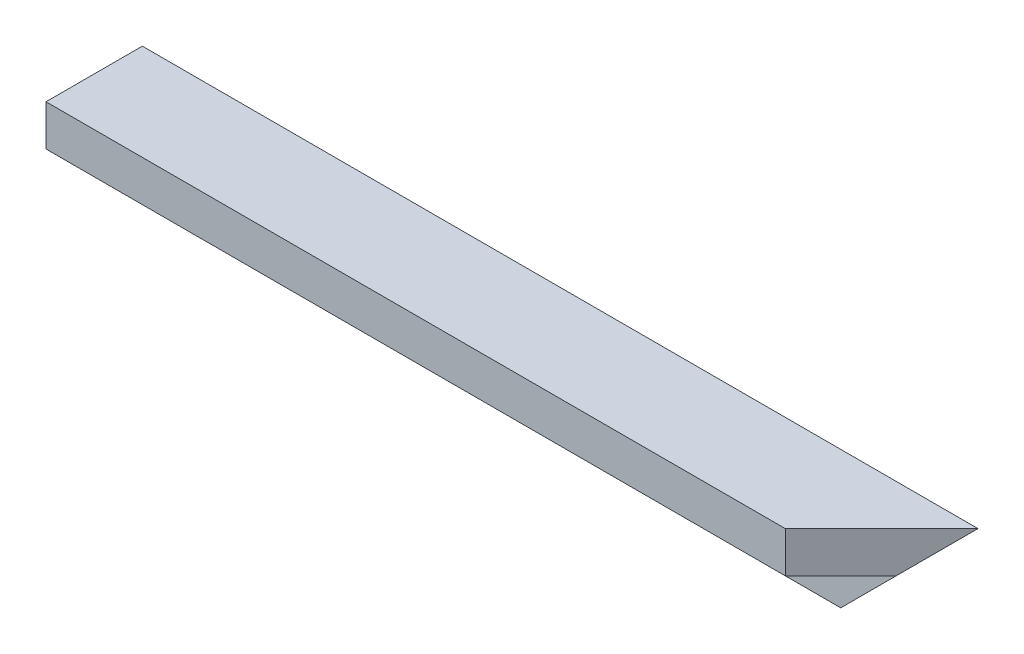
ISO-10303-21;
HEADER;
FILE_DESCRIPTION(('STEP AP214'),'2;1');
FILE_NAME('part.step','',(''),(''),'','','');
FILE_SCHEMA(('AUTOMOTIVE_DESIGN { 1 0 10303 214 1 1 1 1 }'));
ENDSEC;
DATA;
#1=APPLICATION_CONTEXT('core data for automotive mechanical design processes');
#2=APPLICATION_PROTOCOL_DEFINITION('international standard','automotive_design',2000,#1);
#3=PRODUCT_CONTEXT('',#1,'mechanical');
#4=PRODUCT('Part','Part','',(#3));
#5=PRODUCT_RELATED_PRODUCT_CATEGORY('part','',(#4));
#6=PRODUCT_DEFINITION_FORMATION('','',#4);
#7=PRODUCT_DEFINITION_CONTEXT('part definition',#1,'design');
#8=PRODUCT_DEFINITION('design','',#6,#7);
#9=PRODUCT_DEFINITION_SHAPE('','',#8);
#10=(LENGTH_UNIT() NAMED_UNIT(*) SI_UNIT(.MILLI.,.METRE.));
#11=(NAMED_UNIT(*) PLANE_ANGLE_UNIT() SI_UNIT($,.RADIAN.));
#12=(NAMED_UNIT(*) SI_UNIT($,.STERADIAN.) SOLID_ANGLE_UNIT());
#13=UNCERTAINTY_MEASURE_WITH_UNIT(LENGTH_MEASURE(1.E-05),#10,'distance_accuracy_value','');
#14=(GEOMETRIC_REPRESENTATION_CONTEXT(3) GLOBAL_UNCERTAINTY_ASSIGNED_CONTEXT((#13)) GLOBAL_UNIT_ASSIGNED_CONTEXT((#10,
#11,#12)) REPRESENTATION_CONTEXT('',''));
#15=CARTESIAN_POINT('',(0.,0.,0.));
#16=DIRECTION('',(0.,0.,1.));
#17=DIRECTION('',(1.,0.,0.));
#18=AXIS2_PLACEMENT_3D('',#15,#16,#17);
#19=CARTESIAN_POINT('',(221.999999999984,-40.,0.));
#20=DIRECTION('',(0.,0.,1.));
#21=DIRECTION('',(1.,0.,0.));
#22=AXIS2_PLACEMENT_3D('',#19,#20,#21);
#23=PLANE('',#22);
#24=DIRECTION('',(-1.,0.,0.));
#25=VECTOR('',#24,1.);
#26=CARTESIAN_POINT('',(221.999999999984,0.,0.));
#27=LINE('',#26,#25);
#28=CARTESIAN_POINT('',(222.,0.,0.));
#29=VERTEX_POINT('',#28);
#30=CARTESIAN_POINT('',(-125.000000000016,0.,0.));
#31=VERTEX_POINT('',#30);
#32=EDGE_CURVE('E40',#29,#31,#27,.T.);
#33=ORIENTED_EDGE('',*,*,#32,.F.);
#34=DIRECTION('',(0.707106781186548,0.707106781186547,0.));
#35=VECTOR('',#34,1.);
#36=CARTESIAN_POINT('',(222.,0.,0.));
#37=LINE('',#36,#35);
#38=CARTESIAN_POINT('',(182.,-40.,0.));
#39=VERTEX_POINT('',#38);
#40=EDGE_CURVE('E88',#39,#29,#37,.T.);
#41=ORIENTED_EDGE('',*,*,#40,.F.);
#42=DIRECTION('',(-1.,0.,0.));
#43=VECTOR('',#42,1.);
#44=CARTESIAN_POINT('',(221.999999999984,-40.,0.));
#45=LINE('',#44,#43);
#46=CARTESIAN_POINT('',(-125.000000000016,-40.,0.));
#47=VERTEX_POINT('',#46);
#48=EDGE_CURVE('E47',#39,#47,#45,.T.);
#49=ORIENTED_EDGE('',*,*,#48,.T.);
#50=DIRECTION('',(0.,1.,0.));
#51=VECTOR('',#50,1.);
#52=CARTESIAN_POINT('',(-125.000000000016,-40.,0.));
#53=LINE('',#52,#51);
#54=EDGE_CURVE('E118',#47,#31,#53,.T.);
#55=ORIENTED_EDGE('',*,*,#54,.T.);
#56=EDGE_LOOP('',(#33,#41,#49,#55));
#57=FACE_BOUND('',#56,.T.);
#58=ADVANCED_FACE('F33',(#57),#23,.F.);
#59=CARTESIAN_POINT('',(221.999999999984,0.,0.));
#60=DIRECTION('',(0.,-1.,0.));
#61=DIRECTION('',(0.,0.,-1.));
#62=AXIS2_PLACEMENT_3D('',#59,#60,#61);
#63=PLANE('',#62);
#64=DIRECTION('',(-1.,0.,0.));
#65=VECTOR('',#64,1.);
#66=CARTESIAN_POINT('',(221.999999999984,0.,40.));
#67=LINE('',#66,#65);
#68=CARTESIAN_POINT('',(182.,0.,40.));
#69=VERTEX_POINT('',#68);
#70=CARTESIAN_POINT('',(-125.000000000016,0.,40.));
#71=VERTEX_POINT('',#70);
#72=EDGE_CURVE('E109',#69,#71,#67,.T.);
#73=ORIENTED_EDGE('',*,*,#72,.F.);
#74=DIRECTION('',(-0.707106781186548,0.,0.707106781186547));
#75=VECTOR('',#74,1.);
#76=CARTESIAN_POINT('',(222.,0.,0.));
#77=LINE('',#76,#75);
#78=EDGE_CURVE('E117',#29,#69,#77,.T.);
#79=ORIENTED_EDGE('',*,*,#78,.F.);
#80=ORIENTED_EDGE('',*,*,#32,.T.);
#81=DIRECTION('',(0.,0.,1.));
#82=VECTOR('',#81,1.);
#83=CARTESIAN_POINT('',(-125.000000000016,0.,0.));
#84=LINE('',#83,#82);
#85=EDGE_CURVE('E115',#31,#71,#84,.T.);
#86=ORIENTED_EDGE('',*,*,#85,.T.);
#87=EDGE_LOOP('',(#73,#79,#80,#86));
#88=FACE_BOUND('',#87,.T.);
#89=ADVANCED_FACE('F114',(#88),#63,.F.);
#90=CARTESIAN_POINT('',(221.999999999984,0.,40.));
#91=DIRECTION('',(0.,0.,-1.));
#92=DIRECTION('',(-1.,0.,0.));
#93=AXIS2_PLACEMENT_3D('',#90,#91,#92);
#94=PLANE('',#93);
#95=DIRECTION('',(-1.,0.,0.));
#96=VECTOR('',#95,1.);
#97=CARTESIAN_POINT('',(221.999999999984,-17.,40.));
#98=LINE('',#97,#96);
#99=CARTESIAN_POINT('',(182.,-17.,40.));
#100=VERTEX_POINT('',#99);
#101=CARTESIAN_POINT('',(-125.000000000016,-17.,40.));
#102=VERTEX_POINT('',#101);
#103=EDGE_CURVE('E107',#100,#102,#98,.T.);
#104=ORIENTED_EDGE('',*,*,#103,.F.);
#105=DIRECTION('',(0.,1.,0.));
#106=VECTOR('',#105,1.);
#107=CARTESIAN_POINT('',(182.,-40.,40.));
#108=LINE('',#107,#106);
#109=EDGE_CURVE('E125',#100,#69,#108,.T.);
#110=ORIENTED_EDGE('',*,*,#109,.T.);
#111=ORIENTED_EDGE('',*,*,#72,.T.);
#112=DIRECTION('',(0.,-1.,0.));
#113=VECTOR('',#112,1.);
#114=CARTESIAN_POINT('',(-125.000000000016,0.,40.));
#115=LINE('',#114,#113);
#116=EDGE_CURVE('E122',#71,#102,#115,.T.);
#117=ORIENTED_EDGE('',*,*,#116,.T.);
#118=EDGE_LOOP('',(#104,#110,#111,#117));
#119=FACE_BOUND('',#118,.T.);
#120=ADVANCED_FACE('F153',(#119),#94,.F.);
#121=CARTESIAN_POINT('',(221.999999999984,-17.,40.));
#122=DIRECTION('',(0.,1.,0.));
#123=DIRECTION('',(0.,0.,1.));
#124=AXIS2_PLACEMENT_3D('',#121,#122,#123);
#125=PLANE('',#124);
#126=DIRECTION('',(-1.,0.,0.));
#127=VECTOR('',#126,1.);
#128=CARTESIAN_POINT('',(221.999999999984,-17.,17.));
#129=LINE('',#128,#127);
#130=CARTESIAN_POINT('',(205.,-17.,17.));
#131=VERTEX_POINT('',#130);
#132=CARTESIAN_POINT('',(-125.000000000016,-17.,17.));
#133=VERTEX_POINT('',#132);
#134=EDGE_CURVE('E100',#131,#133,#129,.T.);
#135=ORIENTED_EDGE('',*,*,#134,.F.);
#136=DIRECTION('',(-0.707106781186548,0.,0.707106781186548));
#137=VECTOR('',#136,1.);
#138=CARTESIAN_POINT('',(201.999999999992,-17.,20.0000000000081));
#139=LINE('',#138,#137);
#140=EDGE_CURVE('E120',#131,#100,#139,.T.);
#141=ORIENTED_EDGE('',*,*,#140,.T.);
#142=ORIENTED_EDGE('',*,*,#103,.T.);
#143=DIRECTION('',(0.,0.,-1.));
#144=VECTOR('',#143,1.);
#145=CARTESIAN_POINT('',(-125.000000000016,-17.,40.));
#146=LINE('',#145,#144);
#147=EDGE_CURVE('E131',#102,#133,#146,.T.);
#148=ORIENTED_EDGE('',*,*,#147,.T.);
#149=EDGE_LOOP('',(#135,#141,#142,#148));
#150=FACE_BOUND('',#149,.T.);
#151=ADVANCED_FACE('F157',(#150),#125,.F.);
#152=CARTESIAN_POINT('',(221.999999999984,-17.,17.));
#153=DIRECTION('',(0.,0.,-1.));
#154=DIRECTION('',(0.,1.,0.));
#155=AXIS2_PLACEMENT_3D('',#152,#153,#154);
#156=PLANE('',#155);
#157=DIRECTION('',(-1.,0.,0.));
#158=VECTOR('',#157,1.);
#159=CARTESIAN_POINT('',(221.999999999984,-40.,17.));
#160=LINE('',#159,#158);
#161=CARTESIAN_POINT('',(182.,-40.,17.));
#162=VERTEX_POINT('',#161);
#163=CARTESIAN_POINT('',(-125.000000000016,-40.,17.));
#164=VERTEX_POINT('',#163);
#165=EDGE_CURVE('E54',#162,#164,#160,.T.);
#166=ORIENTED_EDGE('',*,*,#165,.F.);
#167=DIRECTION('',(0.707106781186548,0.707106781186547,0.));
#168=VECTOR('',#167,1.);
#169=CARTESIAN_POINT('',(213.499999999992,-8.50000000000811,17.));
#170=LINE('',#169,#168);
#171=EDGE_CURVE('E90',#162,#131,#170,.T.);
#172=ORIENTED_EDGE('',*,*,#171,.T.);
#173=ORIENTED_EDGE('',*,*,#134,.T.);
#174=DIRECTION('',(0.,-1.,0.));
#175=VECTOR('',#174,1.);
#176=CARTESIAN_POINT('',(-125.000000000016,-17.,17.));
#177=LINE('',#176,#175);
#178=EDGE_CURVE('E102',#133,#164,#177,.T.);
#179=ORIENTED_EDGE('',*,*,#178,.T.);
#180=EDGE_LOOP('',(#166,#172,#173,#179));
#181=FACE_BOUND('',#180,.T.);
#182=ADVANCED_FACE('F135',(#181),#156,.F.);
#183=CARTESIAN_POINT('',(221.999999999984,-40.,17.));
#184=DIRECTION('',(0.,1.,0.));
#185=DIRECTION('',(0.,0.,1.));
#186=AXIS2_PLACEMENT_3D('',#183,#184,#185);
#187=PLANE('',#186);
#188=ORIENTED_EDGE('',*,*,#48,.F.);
#189=DIRECTION('',(0.,0.,-1.));
#190=VECTOR('',#189,1.);
#191=CARTESIAN_POINT('',(182.,-40.,40.));
#192=LINE('',#191,#190);
#193=EDGE_CURVE('E86',#162,#39,#192,.T.);
#194=ORIENTED_EDGE('',*,*,#193,.F.);
#195=ORIENTED_EDGE('',*,*,#165,.T.);
#196=DIRECTION('',(0.,0.,-1.));
#197=VECTOR('',#196,1.);
#198=CARTESIAN_POINT('',(-125.000000000016,-40.,17.));
#199=LINE('',#198,#197);
#200=EDGE_CURVE('E97',#164,#47,#199,.T.);
#201=ORIENTED_EDGE('',*,*,#200,.T.);
#202=EDGE_LOOP('',(#188,#194,#195,#201));
#203=FACE_BOUND('',#202,.T.);
#204=ADVANCED_FACE('F95',(#203),#187,.F.);
#205=CARTESIAN_POINT('',(-125.000000000016,0.,0.));
#206=DIRECTION('',(1.,0.,0.));
#207=DIRECTION('',(0.,0.,-1.));
#208=AXIS2_PLACEMENT_3D('',#205,#206,#207);
#209=PLANE('',#208);
#210=ORIENTED_EDGE('',*,*,#54,.F.);
#211=ORIENTED_EDGE('',*,*,#200,.F.);
#212=ORIENTED_EDGE('',*,*,#178,.F.);
#213=ORIENTED_EDGE('',*,*,#147,.F.);
#214=ORIENTED_EDGE('',*,*,#116,.F.);
#215=ORIENTED_EDGE('',*,*,#85,.F.);
#216=EDGE_LOOP('',(#210,#211,#212,#213,#214,#215));
#217=FACE_BOUND('',#216,.T.);
#218=ADVANCED_FACE('F138',(#217),#209,.F.);
#219=CARTESIAN_POINT('',(222.,-40.,0.));
#220=DIRECTION('',(-0.707106781186548,0.,-0.707106781186548));
#221=DIRECTION('',(-0.707106781186548,0.,0.707106781186548));
#222=AXIS2_PLACEMENT_3D('',#219,#220,#221);
#223=PLANE('',#222);
#224=ORIENTED_EDGE('',*,*,#140,.F.);
#225=DIRECTION('',(0.577350269189626,0.577350269189626,-0.577350269189626));
#226=VECTOR('',#225,1.);
#227=CARTESIAN_POINT('',(208.666666666667,-13.3333333333333,13.3333333333333));
#228=LINE('',#227,#226);
#229=EDGE_CURVE('E11',#131,#29,#228,.T.);
#230=ORIENTED_EDGE('',*,*,#229,.T.);
#231=ORIENTED_EDGE('',*,*,#78,.T.);
#232=ORIENTED_EDGE('',*,*,#109,.F.);
#233=EDGE_LOOP('',(#224,#230,#231,#232));
#234=FACE_BOUND('',#233,.T.);
#235=ADVANCED_FACE('F140',(#234),#223,.F.);
#236=CARTESIAN_POINT('',(222.,0.,40.));
#237=DIRECTION('',(-0.707106781186547,0.707106781186548,0.));
#238=DIRECTION('',(-0.707106781186548,-0.707106781186547,0.));
#239=AXIS2_PLACEMENT_3D('',#236,#237,#238);
#240=PLANE('',#239);
#241=ORIENTED_EDGE('',*,*,#193,.T.);
#242=ORIENTED_EDGE('',*,*,#40,.T.);
#243=ORIENTED_EDGE('',*,*,#229,.F.);
#244=ORIENTED_EDGE('',*,*,#171,.F.);
#245=EDGE_LOOP('',(#241,#242,#243,#244));
#246=FACE_BOUND('',#245,.T.);
#247=ADVANCED_FACE('F87',(#246),#240,.F.);
#248=CLOSED_SHELL('',(#58,#89,#120,#151,#182,#204,#218,#235,#247));
#249=MANIFOLD_SOLID_BREP('B2',#248);
#250=ADVANCED_BREP_SHAPE_REPRESENTATION('',(#18,#249),#14);
#251=SHAPE_DEFINITION_REPRESENTATION(#9,#250);
ENDSEC;
END-ISO-10303-21;
